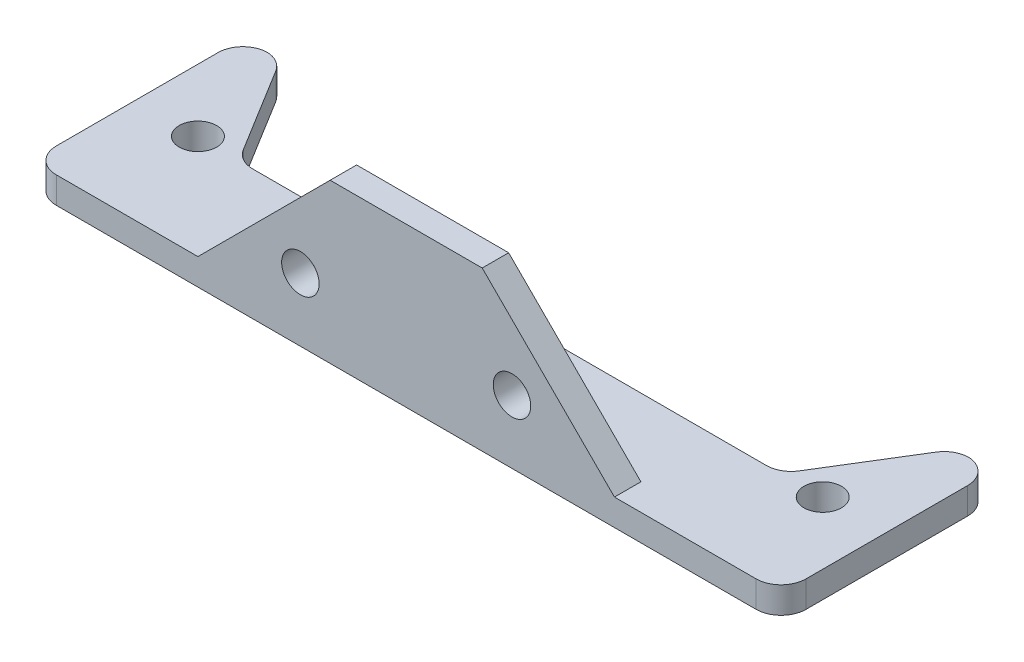
ISO-10303-21;
HEADER;
FILE_DESCRIPTION(('STEP AP214'),'2;1');
FILE_NAME('part.step','',(''),(''),'','','');
FILE_SCHEMA(('AUTOMOTIVE_DESIGN { 1 0 10303 214 1 1 1 1 }'));
ENDSEC;
DATA;
#1=APPLICATION_CONTEXT('core data for automotive mechanical design processes');
#2=APPLICATION_PROTOCOL_DEFINITION('international standard','automotive_design',2000,#1);
#3=PRODUCT_CONTEXT('',#1,'mechanical');
#4=PRODUCT('Part','Part','',(#3));
#5=PRODUCT_RELATED_PRODUCT_CATEGORY('part','',(#4));
#6=PRODUCT_DEFINITION_FORMATION('','',#4);
#7=PRODUCT_DEFINITION_CONTEXT('part definition',#1,'design');
#8=PRODUCT_DEFINITION('design','',#6,#7);
#9=PRODUCT_DEFINITION_SHAPE('','',#8);
#10=(LENGTH_UNIT() NAMED_UNIT(*) SI_UNIT(.MILLI.,.METRE.));
#11=(NAMED_UNIT(*) PLANE_ANGLE_UNIT() SI_UNIT($,.RADIAN.));
#12=(NAMED_UNIT(*) SI_UNIT($,.STERADIAN.) SOLID_ANGLE_UNIT());
#13=UNCERTAINTY_MEASURE_WITH_UNIT(LENGTH_MEASURE(1.E-05),#10,'distance_accuracy_value','');
#14=(GEOMETRIC_REPRESENTATION_CONTEXT(3) GLOBAL_UNCERTAINTY_ASSIGNED_CONTEXT((#13)) GLOBAL_UNIT_ASSIGNED_CONTEXT((#10,
#11,#12)) REPRESENTATION_CONTEXT('',''));
#15=CARTESIAN_POINT('',(0.,0.,0.));
#16=DIRECTION('',(0.,0.,1.));
#17=DIRECTION('',(1.,0.,0.));
#18=AXIS2_PLACEMENT_3D('',#15,#16,#17);
#19=CARTESIAN_POINT('',(25.,0.,-3.175));
#20=DIRECTION('',(0.,-1.,0.));
#21=DIRECTION('',(0.,0.,-1.));
#22=AXIS2_PLACEMENT_3D('',#19,#20,#21);
#23=PLANE('',#22);
#24=DIRECTION('',(-1.,0.,0.));
#25=VECTOR('',#24,1.);
#26=CARTESIAN_POINT('',(25.,0.,0.));
#27=LINE('',#26,#25);
#28=CARTESIAN_POINT('',(9.12500000000006,0.,0.));
#29=VERTEX_POINT('',#28);
#30=CARTESIAN_POINT('',(-9.12499999999983,0.,0.));
#31=VERTEX_POINT('',#30);
#32=EDGE_CURVE('E192',#29,#31,#27,.T.);
#33=ORIENTED_EDGE('',*,*,#32,.F.);
#34=DIRECTION('',(0.,0.,-1.));
#35=VECTOR('',#34,1.);
#36=CARTESIAN_POINT('',(9.12500000000006,0.,0.));
#37=LINE('',#36,#35);
#38=CARTESIAN_POINT('',(9.12500000000006,0.,-3.175));
#39=VERTEX_POINT('',#38);
#40=EDGE_CURVE('E198',#29,#39,#37,.T.);
#41=ORIENTED_EDGE('',*,*,#40,.T.);
#42=DIRECTION('',(-1.,0.,0.));
#43=VECTOR('',#42,1.);
#44=CARTESIAN_POINT('',(25.,0.,-3.175));
#45=LINE('',#44,#43);
#46=CARTESIAN_POINT('',(-9.12499999999983,0.,-3.175));
#47=VERTEX_POINT('',#46);
#48=EDGE_CURVE('E201',#39,#47,#45,.T.);
#49=ORIENTED_EDGE('',*,*,#48,.T.);
#50=DIRECTION('',(0.,0.,-1.));
#51=VECTOR('',#50,1.);
#52=CARTESIAN_POINT('',(-9.12499999999983,0.,0.));
#53=LINE('',#52,#51);
#54=EDGE_CURVE('E186',#31,#47,#53,.T.);
#55=ORIENTED_EDGE('',*,*,#54,.F.);
#56=EDGE_LOOP('',(#33,#41,#49,#55));
#57=FACE_BOUND('',#56,.T.);
#58=ADVANCED_FACE('F41',(#57),#23,.F.);
#59=CARTESIAN_POINT('',(25.,0.,0.));
#60=DIRECTION('',(0.,0.,-1.));
#61=DIRECTION('',(0.,1.,0.));
#62=AXIS2_PLACEMENT_3D('',#59,#60,#61);
#63=PLANE('',#62);
#64=CARTESIAN_POINT('',(12.7000000000001,-11.4453124999999,0.));
#65=DIRECTION('',(0.,0.,-1.));
#66=DIRECTION('',(0.,1.,0.));
#67=AXIS2_PLACEMENT_3D('',#64,#65,#66);
#68=CIRCLE('',#67,2.25);
#69=CARTESIAN_POINT('',(12.7000000000001,-9.19531249999994,0.));
#70=VERTEX_POINT('',#69);
#71=EDGE_CURVE('E355',#70,#70,#68,.T.);
#72=ORIENTED_EDGE('',*,*,#71,.T.);
#73=EDGE_LOOP('',(#72));
#74=FACE_BOUND('',#73,.T.);
#75=CARTESIAN_POINT('',(-12.6999999999999,-11.4453124999999,0.));
#76=DIRECTION('',(0.,0.,-1.));
#77=DIRECTION('',(0.,1.,0.));
#78=AXIS2_PLACEMENT_3D('',#75,#76,#77);
#79=CIRCLE('',#78,2.25);
#80=CARTESIAN_POINT('',(-12.6999999999999,-9.19531249999994,0.));
#81=VERTEX_POINT('',#80);
#82=EDGE_CURVE('E195',#81,#81,#79,.T.);
#83=ORIENTED_EDGE('',*,*,#82,.T.);
#84=EDGE_LOOP('',(#83));
#85=FACE_BOUND('',#84,.T.);
#86=DIRECTION('',(1.,0.,0.));
#87=VECTOR('',#86,1.);
#88=CARTESIAN_POINT('',(-45.,-15.875,0.));
#89=LINE('',#88,#87);
#90=CARTESIAN_POINT('',(-42.,-15.875,0.));
#91=VERTEX_POINT('',#90);
#92=CARTESIAN_POINT('',(-25.,-15.875,0.));
#93=VERTEX_POINT('',#92);
#94=EDGE_CURVE('E165',#91,#93,#89,.T.);
#95=ORIENTED_EDGE('',*,*,#94,.F.);
#96=DIRECTION('',(0.,1.,0.));
#97=VECTOR('',#96,1.);
#98=CARTESIAN_POINT('',(-42.,-19.05,0.));
#99=LINE('',#98,#97);
#100=CARTESIAN_POINT('',(-42.,-19.05,0.));
#101=VERTEX_POINT('',#100);
#102=EDGE_CURVE('E255',#91,#101,#99,.F.);
#103=ORIENTED_EDGE('',*,*,#102,.T.);
#104=DIRECTION('',(-1.,0.,0.));
#105=VECTOR('',#104,1.);
#106=CARTESIAN_POINT('',(25.,-19.05,0.));
#107=LINE('',#106,#105);
#108=CARTESIAN_POINT('',(42.,-19.05,0.));
#109=VERTEX_POINT('',#108);
#110=EDGE_CURVE('E205',#109,#101,#107,.T.);
#111=ORIENTED_EDGE('',*,*,#110,.F.);
#112=DIRECTION('',(0.,-1.,0.));
#113=VECTOR('',#112,1.);
#114=CARTESIAN_POINT('',(42.,-15.875,0.));
#115=LINE('',#114,#113);
#116=CARTESIAN_POINT('',(42.,-15.875,0.));
#117=VERTEX_POINT('',#116);
#118=EDGE_CURVE('E253',#109,#117,#115,.F.);
#119=ORIENTED_EDGE('',*,*,#118,.T.);
#120=DIRECTION('',(-1.,0.,0.));
#121=VECTOR('',#120,1.);
#122=CARTESIAN_POINT('',(45.,-15.875,0.));
#123=LINE('',#122,#121);
#124=CARTESIAN_POINT('',(25.,-15.875,0.));
#125=VERTEX_POINT('',#124);
#126=EDGE_CURVE('E350',#117,#125,#123,.T.);
#127=ORIENTED_EDGE('',*,*,#126,.T.);
#128=DIRECTION('',(-0.707106781186546,0.707106781186549,0.));
#129=VECTOR('',#128,1.);
#130=CARTESIAN_POINT('',(25.,-15.875,0.));
#131=LINE('',#130,#129);
#132=EDGE_CURVE('E214',#125,#29,#131,.T.);
#133=ORIENTED_EDGE('',*,*,#132,.T.);
#134=ORIENTED_EDGE('',*,*,#32,.T.);
#135=DIRECTION('',(-0.707106781186551,-0.707106781186544,0.));
#136=VECTOR('',#135,1.);
#137=CARTESIAN_POINT('',(-25.,-15.875,0.));
#138=LINE('',#137,#136);
#139=EDGE_CURVE('E180',#31,#93,#138,.T.);
#140=ORIENTED_EDGE('',*,*,#139,.T.);
#141=EDGE_LOOP('',(#95,#103,#111,#119,#127,#133,#134,#140));
#142=FACE_BOUND('',#141,.T.);
#143=ADVANCED_FACE('F189',(#74,#85,#142),#63,.F.);
#144=CARTESIAN_POINT('',(25.,-19.05,0.));
#145=DIRECTION('',(0.,1.,0.));
#146=DIRECTION('',(0.,0.,1.));
#147=AXIS2_PLACEMENT_3D('',#144,#145,#146);
#148=PLANE('',#147);
#149=CARTESIAN_POINT('',(37.5,-19.05,-12.5));
#150=DIRECTION('',(0.,1.,0.));
#151=DIRECTION('',(0.,0.,1.));
#152=AXIS2_PLACEMENT_3D('',#149,#150,#151);
#153=CIRCLE('',#152,2.25);
#154=CARTESIAN_POINT('',(37.5,-19.05,-10.25));
#155=VERTEX_POINT('',#154);
#156=EDGE_CURVE('E329',#155,#155,#153,.T.);
#157=ORIENTED_EDGE('',*,*,#156,.T.);
#158=EDGE_LOOP('',(#157));
#159=FACE_BOUND('',#158,.T.);
#160=CARTESIAN_POINT('',(-37.5,-19.05,-12.5));
#161=DIRECTION('',(0.,1.,0.));
#162=DIRECTION('',(0.,0.,1.));
#163=AXIS2_PLACEMENT_3D('',#160,#161,#162);
#164=CIRCLE('',#163,2.25);
#165=CARTESIAN_POINT('',(-37.5,-19.05,-10.25));
#166=VERTEX_POINT('',#165);
#167=EDGE_CURVE('E337',#166,#166,#164,.T.);
#168=ORIENTED_EDGE('',*,*,#167,.T.);
#169=EDGE_LOOP('',(#168));
#170=FACE_BOUND('',#169,.T.);
#171=ORIENTED_EDGE('',*,*,#110,.T.);
#172=CARTESIAN_POINT('',(-42.,-19.05,-3.));
#173=DIRECTION('',(0.,1.,0.));
#174=DIRECTION('',(0.,0.,1.));
#175=AXIS2_PLACEMENT_3D('',#172,#173,#174);
#176=CIRCLE('',#175,3.);
#177=CARTESIAN_POINT('',(-45.,-19.05,-3.));
#178=VERTEX_POINT('',#177);
#179=EDGE_CURVE('E265',#101,#178,#176,.F.);
#180=ORIENTED_EDGE('',*,*,#179,.T.);
#181=DIRECTION('',(0.,0.,1.));
#182=VECTOR('',#181,1.);
#183=CARTESIAN_POINT('',(-45.,-19.05,-25.4));
#184=LINE('',#183,#182);
#185=CARTESIAN_POINT('',(-45.,-19.05,-22.4));
#186=VERTEX_POINT('',#185);
#187=EDGE_CURVE('E340',#186,#178,#184,.T.);
#188=ORIENTED_EDGE('',*,*,#187,.F.);
#189=CARTESIAN_POINT('',(-42.,-19.05,-22.4));
#190=DIRECTION('',(0.,1.,0.));
#191=DIRECTION('',(0.,0.,1.));
#192=AXIS2_PLACEMENT_3D('',#189,#190,#191);
#193=CIRCLE('',#192,3.);
#194=CARTESIAN_POINT('',(-42.0881927910547,-19.05,-25.3987033917355));
#195=VERTEX_POINT('',#194);
#196=EDGE_CURVE('E65',#186,#195,#193,.F.);
#197=ORIENTED_EDGE('',*,*,#196,.T.);
#198=CARTESIAN_POINT('',(-42.1763855821093,-19.05,-22.4));
#199=DIRECTION('',(0.,1.,0.));
#200=DIRECTION('',(0.,0.,1.));
#201=AXIS2_PLACEMENT_3D('',#198,#199,#200);
#202=CIRCLE('',#201,3.);
#203=CARTESIAN_POINT('',(-39.6214106319957,-19.05,-23.972292276993));
#204=VERTEX_POINT('',#203);
#205=EDGE_CURVE('E257',#195,#204,#202,.F.);
#206=ORIENTED_EDGE('',*,*,#205,.T.);
#207=DIRECTION('',(-0.524097425664333,0.,-0.851658316704545));
#208=VECTOR('',#207,1.);
#209=CARTESIAN_POINT('',(-32.5,-19.05,-12.3999999999999));
#210=LINE('',#209,#208);
#211=CARTESIAN_POINT('',(-33.3785893680044,-19.05,-13.827707723007));
#212=VERTEX_POINT('',#211);
#213=EDGE_CURVE('E233',#204,#212,#210,.F.);
#214=ORIENTED_EDGE('',*,*,#213,.T.);
#215=CARTESIAN_POINT('',(-30.8236144178907,-19.05,-15.4));
#216=DIRECTION('',(0.,1.,0.));
#217=DIRECTION('',(0.,0.,1.));
#218=AXIS2_PLACEMENT_3D('',#215,#216,#217);
#219=CIRCLE('',#218,3.);
#220=CARTESIAN_POINT('',(-30.8236144178907,-19.05,-12.4));
#221=VERTEX_POINT('',#220);
#222=EDGE_CURVE('E11',#212,#221,#219,.T.);
#223=ORIENTED_EDGE('',*,*,#222,.T.);
#224=DIRECTION('',(1.,0.,0.));
#225=VECTOR('',#224,1.);
#226=CARTESIAN_POINT('',(-32.5,-19.05,-12.4));
#227=LINE('',#226,#225);
#228=CARTESIAN_POINT('',(30.8236144178907,-19.05,-12.4));
#229=VERTEX_POINT('',#228);
#230=EDGE_CURVE('E298',#221,#229,#227,.T.);
#231=ORIENTED_EDGE('',*,*,#230,.T.);
#232=CARTESIAN_POINT('',(30.8236144178907,-19.05,-15.4));
#233=DIRECTION('',(0.,1.,0.));
#234=DIRECTION('',(0.,0.,1.));
#235=AXIS2_PLACEMENT_3D('',#232,#233,#234);
#236=CIRCLE('',#235,3.);
#237=CARTESIAN_POINT('',(33.3785893680044,-19.05,-13.827707723007));
#238=VERTEX_POINT('',#237);
#239=EDGE_CURVE('E289',#229,#238,#236,.T.);
#240=ORIENTED_EDGE('',*,*,#239,.T.);
#241=DIRECTION('',(0.524097425664333,0.,-0.851658316704545));
#242=VECTOR('',#241,1.);
#243=CARTESIAN_POINT('',(40.5,-19.05,-25.4));
#244=LINE('',#243,#242);
#245=CARTESIAN_POINT('',(39.6214106319957,-19.05,-23.972292276993));
#246=VERTEX_POINT('',#245);
#247=EDGE_CURVE('E228',#238,#246,#244,.T.);
#248=ORIENTED_EDGE('',*,*,#247,.T.);
#249=CARTESIAN_POINT('',(42.1763855821093,-19.05,-22.4));
#250=DIRECTION('',(0.,1.,0.));
#251=DIRECTION('',(0.,0.,1.));
#252=AXIS2_PLACEMENT_3D('',#249,#250,#251);
#253=CIRCLE('',#252,3.);
#254=CARTESIAN_POINT('',(42.0881927910547,-19.05,-25.3987033917355));
#255=VERTEX_POINT('',#254);
#256=EDGE_CURVE('E58',#246,#255,#253,.F.);
#257=ORIENTED_EDGE('',*,*,#256,.T.);
#258=CARTESIAN_POINT('',(42.,-19.05,-22.4));
#259=DIRECTION('',(0.,1.,0.));
#260=DIRECTION('',(0.,0.,1.));
#261=AXIS2_PLACEMENT_3D('',#258,#259,#260);
#262=CIRCLE('',#261,3.);
#263=CARTESIAN_POINT('',(45.,-19.05,-22.4));
#264=VERTEX_POINT('',#263);
#265=EDGE_CURVE('E260',#255,#264,#262,.F.);
#266=ORIENTED_EDGE('',*,*,#265,.T.);
#267=DIRECTION('',(0.,0.,-1.));
#268=VECTOR('',#267,1.);
#269=CARTESIAN_POINT('',(45.,-19.05,0.));
#270=LINE('',#269,#268);
#271=CARTESIAN_POINT('',(45.,-19.05,-3.));
#272=VERTEX_POINT('',#271);
#273=EDGE_CURVE('E175',#272,#264,#270,.T.);
#274=ORIENTED_EDGE('',*,*,#273,.F.);
#275=CARTESIAN_POINT('',(42.,-19.05,-3.));
#276=DIRECTION('',(0.,1.,0.));
#277=DIRECTION('',(0.,0.,1.));
#278=AXIS2_PLACEMENT_3D('',#275,#276,#277);
#279=CIRCLE('',#278,3.);
#280=EDGE_CURVE('E263',#272,#109,#279,.F.);
#281=ORIENTED_EDGE('',*,*,#280,.T.);
#282=EDGE_LOOP('',(#171,#180,#188,#197,#206,#214,#223,#231,#240,#248,#257,#266,#274,#281));
#283=FACE_BOUND('',#282,.T.);
#284=ADVANCED_FACE('F310',(#159,#170,#283),#148,.F.);
#285=CARTESIAN_POINT('',(25.,-15.875,-25.4));
#286=DIRECTION('',(0.,-1.,0.));
#287=DIRECTION('',(0.,0.,-1.));
#288=AXIS2_PLACEMENT_3D('',#285,#286,#287);
#289=PLANE('',#288);
#290=CARTESIAN_POINT('',(37.5,-15.875,-12.5));
#291=DIRECTION('',(0.,1.,0.));
#292=DIRECTION('',(0.,0.,1.));
#293=AXIS2_PLACEMENT_3D('',#290,#291,#292);
#294=CIRCLE('',#293,2.24999999999999);
#295=CARTESIAN_POINT('',(37.5,-15.875,-10.25));
#296=VERTEX_POINT('',#295);
#297=EDGE_CURVE('E326',#296,#296,#294,.T.);
#298=ORIENTED_EDGE('',*,*,#297,.F.);
#299=EDGE_LOOP('',(#298));
#300=FACE_BOUND('',#299,.T.);
#301=CARTESIAN_POINT('',(-37.5,-15.875,-12.5));
#302=DIRECTION('',(0.,1.,0.));
#303=DIRECTION('',(0.,0.,1.));
#304=AXIS2_PLACEMENT_3D('',#301,#302,#303);
#305=CIRCLE('',#304,2.24999999999999);
#306=CARTESIAN_POINT('',(-37.5,-15.875,-10.25));
#307=VERTEX_POINT('',#306);
#308=EDGE_CURVE('E334',#307,#307,#305,.T.);
#309=ORIENTED_EDGE('',*,*,#308,.F.);
#310=EDGE_LOOP('',(#309));
#311=FACE_BOUND('',#310,.T.);
#312=DIRECTION('',(0.,0.,-1.));
#313=VECTOR('',#312,1.);
#314=CARTESIAN_POINT('',(-45.,-15.875,-25.4));
#315=LINE('',#314,#313);
#316=CARTESIAN_POINT('',(-45.,-15.875,-3.));
#317=VERTEX_POINT('',#316);
#318=CARTESIAN_POINT('',(-45.,-15.875,-22.4));
#319=VERTEX_POINT('',#318);
#320=EDGE_CURVE('E176',#317,#319,#315,.T.);
#321=ORIENTED_EDGE('',*,*,#320,.F.);
#322=CARTESIAN_POINT('',(-42.,-15.875,-3.));
#323=DIRECTION('',(0.,-1.,0.));
#324=DIRECTION('',(0.,0.,-1.));
#325=AXIS2_PLACEMENT_3D('',#322,#323,#324);
#326=CIRCLE('',#325,3.);
#327=EDGE_CURVE('E171',#317,#91,#326,.F.);
#328=ORIENTED_EDGE('',*,*,#327,.T.);
#329=ORIENTED_EDGE('',*,*,#94,.T.);
#330=DIRECTION('',(0.,0.,-1.));
#331=VECTOR('',#330,1.);
#332=CARTESIAN_POINT('',(-25.,-15.875,0.));
#333=LINE('',#332,#331);
#334=CARTESIAN_POINT('',(-25.,-15.875,-3.175));
#335=VERTEX_POINT('',#334);
#336=EDGE_CURVE('E169',#93,#335,#333,.T.);
#337=ORIENTED_EDGE('',*,*,#336,.T.);
#338=DIRECTION('',(-1.,0.,0.));
#339=VECTOR('',#338,1.);
#340=CARTESIAN_POINT('',(25.,-15.875,-3.175));
#341=LINE('',#340,#339);
#342=CARTESIAN_POINT('',(25.,-15.875,-3.175));
#343=VERTEX_POINT('',#342);
#344=EDGE_CURVE('E204',#343,#335,#341,.T.);
#345=ORIENTED_EDGE('',*,*,#344,.F.);
#346=DIRECTION('',(0.,0.,-1.));
#347=VECTOR('',#346,1.);
#348=CARTESIAN_POINT('',(25.,-15.875,0.));
#349=LINE('',#348,#347);
#350=EDGE_CURVE('E217',#125,#343,#349,.T.);
#351=ORIENTED_EDGE('',*,*,#350,.F.);
#352=ORIENTED_EDGE('',*,*,#126,.F.);
#353=CARTESIAN_POINT('',(42.,-15.875,-3.));
#354=DIRECTION('',(0.,-1.,0.));
#355=DIRECTION('',(0.,0.,-1.));
#356=AXIS2_PLACEMENT_3D('',#353,#354,#355);
#357=CIRCLE('',#356,3.);
#358=CARTESIAN_POINT('',(45.,-15.875,-3.));
#359=VERTEX_POINT('',#358);
#360=EDGE_CURVE('E250',#117,#359,#357,.F.);
#361=ORIENTED_EDGE('',*,*,#360,.T.);
#362=DIRECTION('',(0.,0.,1.));
#363=VECTOR('',#362,1.);
#364=CARTESIAN_POINT('',(45.,-15.875,0.));
#365=LINE('',#364,#363);
#366=CARTESIAN_POINT('',(45.,-15.875,-22.4));
#367=VERTEX_POINT('',#366);
#368=EDGE_CURVE('E347',#367,#359,#365,.T.);
#369=ORIENTED_EDGE('',*,*,#368,.F.);
#370=CARTESIAN_POINT('',(42.,-15.875,-22.4));
#371=DIRECTION('',(0.,-1.,0.));
#372=DIRECTION('',(0.,0.,-1.));
#373=AXIS2_PLACEMENT_3D('',#370,#371,#372);
#374=CIRCLE('',#373,3.);
#375=CARTESIAN_POINT('',(42.0881927910547,-15.875,-25.3987033917355));
#376=VERTEX_POINT('',#375);
#377=EDGE_CURVE('E246',#367,#376,#374,.F.);
#378=ORIENTED_EDGE('',*,*,#377,.T.);
#379=CARTESIAN_POINT('',(42.1763855821093,-15.875,-22.4));
#380=DIRECTION('',(0.,-1.,0.));
#381=DIRECTION('',(0.,0.,-1.));
#382=AXIS2_PLACEMENT_3D('',#379,#380,#381);
#383=CIRCLE('',#382,3.);
#384=CARTESIAN_POINT('',(39.6214106319957,-15.875,-23.972292276993));
#385=VERTEX_POINT('',#384);
#386=EDGE_CURVE('E248',#376,#385,#383,.F.);
#387=ORIENTED_EDGE('',*,*,#386,.T.);
#388=DIRECTION('',(-0.524097425664333,0.,0.851658316704545));
#389=VECTOR('',#388,1.);
#390=CARTESIAN_POINT('',(40.5,-15.875,-25.4));
#391=LINE('',#390,#389);
#392=CARTESIAN_POINT('',(33.3785893680044,-15.875,-13.827707723007));
#393=VERTEX_POINT('',#392);
#394=EDGE_CURVE('E209',#385,#393,#391,.T.);
#395=ORIENTED_EDGE('',*,*,#394,.T.);
#396=CARTESIAN_POINT('',(30.8236144178907,-15.875,-15.4));
#397=DIRECTION('',(0.,-1.,0.));
#398=DIRECTION('',(0.,0.,-1.));
#399=AXIS2_PLACEMENT_3D('',#396,#397,#398);
#400=CIRCLE('',#399,3.);
#401=CARTESIAN_POINT('',(30.8236144178907,-15.875,-12.4));
#402=VERTEX_POINT('',#401);
#403=EDGE_CURVE('E287',#393,#402,#400,.T.);
#404=ORIENTED_EDGE('',*,*,#403,.T.);
#405=DIRECTION('',(1.,0.,0.));
#406=VECTOR('',#405,1.);
#407=CARTESIAN_POINT('',(-32.5,-15.875,-12.4));
#408=LINE('',#407,#406);
#409=CARTESIAN_POINT('',(-30.8236144178907,-15.875,-12.4));
#410=VERTEX_POINT('',#409);
#411=EDGE_CURVE('E293',#410,#402,#408,.T.);
#412=ORIENTED_EDGE('',*,*,#411,.F.);
#413=CARTESIAN_POINT('',(-30.8236144178907,-15.875,-15.4));
#414=DIRECTION('',(0.,-1.,0.));
#415=DIRECTION('',(0.,0.,-1.));
#416=AXIS2_PLACEMENT_3D('',#413,#414,#415);
#417=CIRCLE('',#416,3.);
#418=CARTESIAN_POINT('',(-33.3785893680044,-15.875,-13.827707723007));
#419=VERTEX_POINT('',#418);
#420=EDGE_CURVE('E50',#410,#419,#417,.T.);
#421=ORIENTED_EDGE('',*,*,#420,.T.);
#422=DIRECTION('',(0.524097425664333,0.,0.851658316704545));
#423=VECTOR('',#422,1.);
#424=CARTESIAN_POINT('',(-32.5,-15.875,-12.3999999999999));
#425=LINE('',#424,#423);
#426=CARTESIAN_POINT('',(-39.6214106319957,-15.875,-23.972292276993));
#427=VERTEX_POINT('',#426);
#428=EDGE_CURVE('E230',#419,#427,#425,.F.);
#429=ORIENTED_EDGE('',*,*,#428,.T.);
#430=CARTESIAN_POINT('',(-42.1763855821093,-15.875,-22.4));
#431=DIRECTION('',(0.,-1.,0.));
#432=DIRECTION('',(0.,0.,-1.));
#433=AXIS2_PLACEMENT_3D('',#430,#431,#432);
#434=CIRCLE('',#433,3.);
#435=CARTESIAN_POINT('',(-42.0881927910547,-15.875,-25.3987033917355));
#436=VERTEX_POINT('',#435);
#437=EDGE_CURVE('E242',#427,#436,#434,.F.);
#438=ORIENTED_EDGE('',*,*,#437,.T.);
#439=CARTESIAN_POINT('',(-42.,-15.875,-22.4));
#440=DIRECTION('',(0.,-1.,0.));
#441=DIRECTION('',(0.,0.,-1.));
#442=AXIS2_PLACEMENT_3D('',#439,#440,#441);
#443=CIRCLE('',#442,3.);
#444=EDGE_CURVE('E244',#436,#319,#443,.F.);
#445=ORIENTED_EDGE('',*,*,#444,.T.);
#446=EDGE_LOOP('',(#321,#328,#329,#337,#345,#351,#352,#361,#369,#378,#387,#395,#404,#412,#421,
#429,#438,#445));
#447=FACE_BOUND('',#446,.T.);
#448=ADVANCED_FACE('F168',(#300,#311,#447),#289,.F.);
#449=CARTESIAN_POINT('',(25.,-15.875,-3.175));
#450=DIRECTION('',(0.,0.,1.));
#451=DIRECTION('',(0.,-1.,0.));
#452=AXIS2_PLACEMENT_3D('',#449,#450,#451);
#453=PLANE('',#452);
#454=CARTESIAN_POINT('',(12.7000000000001,-11.4453124999999,-3.175));
#455=DIRECTION('',(0.,0.,-1.));
#456=DIRECTION('',(0.,1.,0.));
#457=AXIS2_PLACEMENT_3D('',#454,#455,#456);
#458=CIRCLE('',#457,2.24999999999999);
#459=CARTESIAN_POINT('',(12.7000000000001,-9.19531249999996,-3.175));
#460=VERTEX_POINT('',#459);
#461=EDGE_CURVE('E352',#460,#460,#458,.T.);
#462=ORIENTED_EDGE('',*,*,#461,.F.);
#463=EDGE_LOOP('',(#462));
#464=FACE_BOUND('',#463,.T.);
#465=CARTESIAN_POINT('',(-12.6999999999999,-11.4453124999999,-3.175));
#466=DIRECTION('',(0.,0.,-1.));
#467=DIRECTION('',(0.,1.,0.));
#468=AXIS2_PLACEMENT_3D('',#465,#466,#467);
#469=CIRCLE('',#468,2.24999999999999);
#470=CARTESIAN_POINT('',(-12.6999999999999,-9.19531249999996,-3.175));
#471=VERTEX_POINT('',#470);
#472=EDGE_CURVE('E358',#471,#471,#469,.T.);
#473=ORIENTED_EDGE('',*,*,#472,.F.);
#474=EDGE_LOOP('',(#473));
#475=FACE_BOUND('',#474,.T.);
#476=ORIENTED_EDGE('',*,*,#48,.F.);
#477=DIRECTION('',(-0.707106781186546,0.707106781186549,0.));
#478=VECTOR('',#477,1.);
#479=CARTESIAN_POINT('',(25.,-15.875,-3.175));
#480=LINE('',#479,#478);
#481=EDGE_CURVE('E185',#343,#39,#480,.T.);
#482=ORIENTED_EDGE('',*,*,#481,.F.);
#483=ORIENTED_EDGE('',*,*,#344,.T.);
#484=DIRECTION('',(-0.707106781186551,-0.707106781186544,0.));
#485=VECTOR('',#484,1.);
#486=CARTESIAN_POINT('',(-25.,-15.875,-3.175));
#487=LINE('',#486,#485);
#488=EDGE_CURVE('E183',#47,#335,#487,.T.);
#489=ORIENTED_EDGE('',*,*,#488,.F.);
#490=EDGE_LOOP('',(#476,#482,#483,#489));
#491=FACE_BOUND('',#490,.T.);
#492=ADVANCED_FACE('F370',(#464,#475,#491),#453,.F.);
#493=CARTESIAN_POINT('',(-25.,-15.875,0.));
#494=DIRECTION('',(0.707106781186544,-0.707106781186551,0.));
#495=DIRECTION('',(0.707106781186551,0.707106781186544,0.));
#496=AXIS2_PLACEMENT_3D('',#493,#494,#495);
#497=PLANE('',#496);
#498=ORIENTED_EDGE('',*,*,#488,.T.);
#499=ORIENTED_EDGE('',*,*,#336,.F.);
#500=ORIENTED_EDGE('',*,*,#139,.F.);
#501=ORIENTED_EDGE('',*,*,#54,.T.);
#502=EDGE_LOOP('',(#498,#499,#500,#501));
#503=FACE_BOUND('',#502,.T.);
#504=ADVANCED_FACE('F179',(#503),#497,.F.);
#505=CARTESIAN_POINT('',(25.,-15.875,0.));
#506=DIRECTION('',(-0.707106781186549,-0.707106781186546,0.));
#507=DIRECTION('',(0.707106781186546,-0.707106781186549,0.));
#508=AXIS2_PLACEMENT_3D('',#505,#506,#507);
#509=PLANE('',#508);
#510=ORIENTED_EDGE('',*,*,#481,.T.);
#511=ORIENTED_EDGE('',*,*,#40,.F.);
#512=ORIENTED_EDGE('',*,*,#132,.F.);
#513=ORIENTED_EDGE('',*,*,#350,.T.);
#514=EDGE_LOOP('',(#510,#511,#512,#513));
#515=FACE_BOUND('',#514,.T.);
#516=ADVANCED_FACE('F373',(#515),#509,.F.);
#517=CARTESIAN_POINT('',(-12.6999999999999,-11.4453124999999,-3.175));
#518=DIRECTION('',(0.,0.,-1.));
#519=DIRECTION('',(0.,1.,0.));
#520=AXIS2_PLACEMENT_3D('',#517,#518,#519);
#521=CYLINDRICAL_SURFACE('',#520,2.24999999999999);
#522=ORIENTED_EDGE('',*,*,#82,.F.);
#523=EDGE_LOOP('',(#522));
#524=FACE_BOUND('',#523,.T.);
#525=ORIENTED_EDGE('',*,*,#472,.T.);
#526=EDGE_LOOP('',(#525));
#527=FACE_BOUND('',#526,.T.);
#528=ADVANCED_FACE('F375',(#524,#527),#521,.F.);
#529=CARTESIAN_POINT('',(12.7000000000001,-11.4453124999999,-3.175));
#530=DIRECTION('',(0.,0.,-1.));
#531=DIRECTION('',(0.,1.,0.));
#532=AXIS2_PLACEMENT_3D('',#529,#530,#531);
#533=CYLINDRICAL_SURFACE('',#532,2.24999999999999);
#534=ORIENTED_EDGE('',*,*,#71,.F.);
#535=EDGE_LOOP('',(#534));
#536=FACE_BOUND('',#535,.T.);
#537=ORIENTED_EDGE('',*,*,#461,.T.);
#538=EDGE_LOOP('',(#537));
#539=FACE_BOUND('',#538,.T.);
#540=ADVANCED_FACE('F382',(#536,#539),#533,.F.);
#541=CARTESIAN_POINT('',(45.,0.,0.));
#542=DIRECTION('',(1.,0.,0.));
#543=DIRECTION('',(0.,0.,-1.));
#544=AXIS2_PLACEMENT_3D('',#541,#542,#543);
#545=PLANE('',#544);
#546=ORIENTED_EDGE('',*,*,#368,.T.);
#547=DIRECTION('',(0.,-1.,0.));
#548=VECTOR('',#547,1.);
#549=CARTESIAN_POINT('',(45.,-19.05,-3.));
#550=LINE('',#549,#548);
#551=EDGE_CURVE('E269',#359,#272,#550,.T.);
#552=ORIENTED_EDGE('',*,*,#551,.T.);
#553=ORIENTED_EDGE('',*,*,#273,.T.);
#554=DIRECTION('',(0.,1.,0.));
#555=VECTOR('',#554,1.);
#556=CARTESIAN_POINT('',(45.,-15.875,-22.4));
#557=LINE('',#556,#555);
#558=EDGE_CURVE('E267',#264,#367,#557,.T.);
#559=ORIENTED_EDGE('',*,*,#558,.T.);
#560=EDGE_LOOP('',(#546,#552,#553,#559));
#561=FACE_BOUND('',#560,.T.);
#562=ADVANCED_FACE('F492',(#561),#545,.T.);
#563=CARTESIAN_POINT('',(-45.,0.,0.));
#564=DIRECTION('',(-1.,0.,0.));
#565=DIRECTION('',(0.,0.,1.));
#566=AXIS2_PLACEMENT_3D('',#563,#564,#565);
#567=PLANE('',#566);
#568=ORIENTED_EDGE('',*,*,#187,.T.);
#569=DIRECTION('',(0.,1.,0.));
#570=VECTOR('',#569,1.);
#571=CARTESIAN_POINT('',(-45.,-15.875,-3.));
#572=LINE('',#571,#570);
#573=EDGE_CURVE('E239',#178,#317,#572,.T.);
#574=ORIENTED_EDGE('',*,*,#573,.T.);
#575=ORIENTED_EDGE('',*,*,#320,.T.);
#576=DIRECTION('',(0.,-1.,0.));
#577=VECTOR('',#576,1.);
#578=CARTESIAN_POINT('',(-45.,-19.05,-22.4));
#579=LINE('',#578,#577);
#580=EDGE_CURVE('E236',#319,#186,#579,.T.);
#581=ORIENTED_EDGE('',*,*,#580,.T.);
#582=EDGE_LOOP('',(#568,#574,#575,#581));
#583=FACE_BOUND('',#582,.T.);
#584=ADVANCED_FACE('F487',(#583),#567,.T.);
#585=CARTESIAN_POINT('',(-37.5,-15.875,-12.5));
#586=DIRECTION('',(0.,1.,0.));
#587=DIRECTION('',(0.,0.,1.));
#588=AXIS2_PLACEMENT_3D('',#585,#586,#587);
#589=CYLINDRICAL_SURFACE('',#588,2.25);
#590=ORIENTED_EDGE('',*,*,#167,.F.);
#591=EDGE_LOOP('',(#590));
#592=FACE_BOUND('',#591,.T.);
#593=ORIENTED_EDGE('',*,*,#308,.T.);
#594=EDGE_LOOP('',(#593));
#595=FACE_BOUND('',#594,.T.);
#596=ADVANCED_FACE('F491',(#592,#595),#589,.F.);
#597=CARTESIAN_POINT('',(37.5,-15.875,-12.5));
#598=DIRECTION('',(0.,1.,0.));
#599=DIRECTION('',(0.,0.,1.));
#600=AXIS2_PLACEMENT_3D('',#597,#598,#599);
#601=CYLINDRICAL_SURFACE('',#600,2.25);
#602=ORIENTED_EDGE('',*,*,#156,.F.);
#603=EDGE_LOOP('',(#602));
#604=FACE_BOUND('',#603,.T.);
#605=ORIENTED_EDGE('',*,*,#297,.T.);
#606=EDGE_LOOP('',(#605));
#607=FACE_BOUND('',#606,.T.);
#608=ADVANCED_FACE('F481',(#604,#607),#601,.F.);
#609=CARTESIAN_POINT('',(-32.5,-19.05,-12.4));
#610=DIRECTION('',(0.,0.,1.));
#611=DIRECTION('',(0.,-1.,0.));
#612=AXIS2_PLACEMENT_3D('',#609,#610,#611);
#613=PLANE('',#612);
#614=ORIENTED_EDGE('',*,*,#411,.T.);
#615=DIRECTION('',(0.,1.,0.));
#616=VECTOR('',#615,1.);
#617=CARTESIAN_POINT('',(30.8236144178907,-19.05,-12.4));
#618=LINE('',#617,#616);
#619=EDGE_CURVE('E281',#402,#229,#618,.F.);
#620=ORIENTED_EDGE('',*,*,#619,.T.);
#621=ORIENTED_EDGE('',*,*,#230,.F.);
#622=DIRECTION('',(0.,-1.,0.));
#623=VECTOR('',#622,1.);
#624=CARTESIAN_POINT('',(-30.8236144178907,-19.05,-12.4));
#625=LINE('',#624,#623);
#626=EDGE_CURVE('E278',#221,#410,#625,.F.);
#627=ORIENTED_EDGE('',*,*,#626,.T.);
#628=EDGE_LOOP('',(#614,#620,#621,#627));
#629=FACE_BOUND('',#628,.T.);
#630=ADVANCED_FACE('F323',(#629),#613,.F.);
#631=CARTESIAN_POINT('',(40.5,-19.05,-25.4));
#632=DIRECTION('',(-0.851658316704545,0.,-0.524097425664333));
#633=DIRECTION('',(0.,-1.,0.));
#634=AXIS2_PLACEMENT_3D('',#631,#632,#633);
#635=PLANE('',#634);
#636=ORIENTED_EDGE('',*,*,#247,.F.);
#637=DIRECTION('',(0.,1.,0.));
#638=VECTOR('',#637,1.);
#639=CARTESIAN_POINT('',(33.3785893680044,-19.05,-13.827707723007));
#640=LINE('',#639,#638);
#641=EDGE_CURVE('E275',#238,#393,#640,.T.);
#642=ORIENTED_EDGE('',*,*,#641,.T.);
#643=ORIENTED_EDGE('',*,*,#394,.F.);
#644=DIRECTION('',(0.,1.,0.));
#645=VECTOR('',#644,1.);
#646=CARTESIAN_POINT('',(39.6214106319957,-19.05,-23.972292276993));
#647=LINE('',#646,#645);
#648=EDGE_CURVE('E272',#385,#246,#647,.F.);
#649=ORIENTED_EDGE('',*,*,#648,.T.);
#650=EDGE_LOOP('',(#636,#642,#643,#649));
#651=FACE_BOUND('',#650,.T.);
#652=ADVANCED_FACE('F397',(#651),#635,.T.);
#653=CARTESIAN_POINT('',(-32.5,-19.05,-12.3999999999999));
#654=DIRECTION('',(-0.851658316704545,0.,0.524097425664333));
#655=DIRECTION('',(0.,1.,0.));
#656=AXIS2_PLACEMENT_3D('',#653,#654,#655);
#657=PLANE('',#656);
#658=ORIENTED_EDGE('',*,*,#428,.F.);
#659=DIRECTION('',(0.,1.,0.));
#660=VECTOR('',#659,1.);
#661=CARTESIAN_POINT('',(-33.3785893680044,-19.05,-13.827707723007));
#662=LINE('',#661,#660);
#663=EDGE_CURVE('E285',#419,#212,#662,.F.);
#664=ORIENTED_EDGE('',*,*,#663,.T.);
#665=ORIENTED_EDGE('',*,*,#213,.F.);
#666=DIRECTION('',(0.,-1.,0.));
#667=VECTOR('',#666,1.);
#668=CARTESIAN_POINT('',(-39.6214106319957,-15.875,-23.972292276993));
#669=LINE('',#668,#667);
#670=EDGE_CURVE('E283',#204,#427,#669,.F.);
#671=ORIENTED_EDGE('',*,*,#670,.T.);
#672=EDGE_LOOP('',(#658,#664,#665,#671));
#673=FACE_BOUND('',#672,.T.);
#674=ADVANCED_FACE('F314',(#673),#657,.F.);
#675=CARTESIAN_POINT('',(-42.,0.,-3.));
#676=DIRECTION('',(0.,-1.,0.));
#677=DIRECTION('',(0.,0.,-1.));
#678=AXIS2_PLACEMENT_3D('',#675,#676,#677);
#679=CYLINDRICAL_SURFACE('',#678,3.);
#680=ORIENTED_EDGE('',*,*,#179,.F.);
#681=ORIENTED_EDGE('',*,*,#102,.F.);
#682=ORIENTED_EDGE('',*,*,#327,.F.);
#683=ORIENTED_EDGE('',*,*,#573,.F.);
#684=EDGE_LOOP('',(#680,#681,#682,#683));
#685=FACE_BOUND('',#684,.T.);
#686=ADVANCED_FACE('F408',(#685),#679,.T.);
#687=CARTESIAN_POINT('',(42.,0.,-3.));
#688=DIRECTION('',(0.,1.,0.));
#689=DIRECTION('',(0.,0.,1.));
#690=AXIS2_PLACEMENT_3D('',#687,#688,#689);
#691=CYLINDRICAL_SURFACE('',#690,3.);
#692=ORIENTED_EDGE('',*,*,#360,.F.);
#693=ORIENTED_EDGE('',*,*,#118,.F.);
#694=ORIENTED_EDGE('',*,*,#280,.F.);
#695=ORIENTED_EDGE('',*,*,#551,.F.);
#696=EDGE_LOOP('',(#692,#693,#694,#695));
#697=FACE_BOUND('',#696,.T.);
#698=ADVANCED_FACE('F411',(#697),#691,.T.);
#699=CARTESIAN_POINT('',(30.8236144178907,-19.05,-15.4));
#700=DIRECTION('',(0.,1.,0.));
#701=DIRECTION('',(0.,0.,1.));
#702=AXIS2_PLACEMENT_3D('',#699,#700,#701);
#703=CYLINDRICAL_SURFACE('',#702,3.);
#704=ORIENTED_EDGE('',*,*,#239,.F.);
#705=ORIENTED_EDGE('',*,*,#619,.F.);
#706=ORIENTED_EDGE('',*,*,#403,.F.);
#707=ORIENTED_EDGE('',*,*,#641,.F.);
#708=EDGE_LOOP('',(#704,#705,#706,#707));
#709=FACE_BOUND('',#708,.T.);
#710=ADVANCED_FACE('F415',(#709),#703,.F.);
#711=CARTESIAN_POINT('',(42.,0.,-22.4));
#712=DIRECTION('',(0.,-1.,0.));
#713=DIRECTION('',(0.,0.,-1.));
#714=AXIS2_PLACEMENT_3D('',#711,#712,#713);
#715=CYLINDRICAL_SURFACE('',#714,3.);
#716=ORIENTED_EDGE('',*,*,#558,.F.);
#717=ORIENTED_EDGE('',*,*,#265,.F.);
#718=DIRECTION('',(0.,-1.,0.));
#719=VECTOR('',#718,1.);
#720=CARTESIAN_POINT('',(42.0881927910547,-17.4625,-25.3987033917355));
#721=LINE('',#720,#719);
#722=EDGE_CURVE('E291',#376,#255,#721,.T.);
#723=ORIENTED_EDGE('',*,*,#722,.F.);
#724=ORIENTED_EDGE('',*,*,#377,.F.);
#725=EDGE_LOOP('',(#716,#717,#723,#724));
#726=FACE_BOUND('',#725,.T.);
#727=ADVANCED_FACE('F419',(#726),#715,.T.);
#728=CARTESIAN_POINT('',(42.1763855821093,-19.05,-22.4));
#729=DIRECTION('',(0.,-1.,0.));
#730=DIRECTION('',(0.,0.,-1.));
#731=AXIS2_PLACEMENT_3D('',#728,#729,#730);
#732=CYLINDRICAL_SURFACE('',#731,3.);
#733=ORIENTED_EDGE('',*,*,#256,.F.);
#734=ORIENTED_EDGE('',*,*,#648,.F.);
#735=ORIENTED_EDGE('',*,*,#386,.F.);
#736=ORIENTED_EDGE('',*,*,#722,.T.);
#737=EDGE_LOOP('',(#733,#734,#735,#736));
#738=FACE_BOUND('',#737,.T.);
#739=ADVANCED_FACE('F421',(#738),#732,.T.);
#740=CARTESIAN_POINT('',(-30.8236144178907,-19.05,-15.4));
#741=DIRECTION('',(0.,-1.,0.));
#742=DIRECTION('',(0.,0.,-1.));
#743=AXIS2_PLACEMENT_3D('',#740,#741,#742);
#744=CYLINDRICAL_SURFACE('',#743,3.);
#745=ORIENTED_EDGE('',*,*,#222,.F.);
#746=ORIENTED_EDGE('',*,*,#663,.F.);
#747=ORIENTED_EDGE('',*,*,#420,.F.);
#748=ORIENTED_EDGE('',*,*,#626,.F.);
#749=EDGE_LOOP('',(#745,#746,#747,#748));
#750=FACE_BOUND('',#749,.T.);
#751=ADVANCED_FACE('F317',(#750),#744,.F.);
#752=CARTESIAN_POINT('',(-42.1763855821093,-19.05,-22.4));
#753=DIRECTION('',(0.,-1.,0.));
#754=DIRECTION('',(0.,0.,-1.));
#755=AXIS2_PLACEMENT_3D('',#752,#753,#754);
#756=CYLINDRICAL_SURFACE('',#755,3.);
#757=DIRECTION('',(0.,-1.,0.));
#758=VECTOR('',#757,1.);
#759=CARTESIAN_POINT('',(-42.0881927910547,-17.4625,-25.3987033917355));
#760=LINE('',#759,#758);
#761=EDGE_CURVE('E45',#436,#195,#760,.T.);
#762=ORIENTED_EDGE('',*,*,#761,.F.);
#763=ORIENTED_EDGE('',*,*,#437,.F.);
#764=ORIENTED_EDGE('',*,*,#670,.F.);
#765=ORIENTED_EDGE('',*,*,#205,.F.);
#766=EDGE_LOOP('',(#762,#763,#764,#765));
#767=FACE_BOUND('',#766,.T.);
#768=ADVANCED_FACE('F43',(#767),#756,.T.);
#769=CARTESIAN_POINT('',(-42.,0.,-22.4));
#770=DIRECTION('',(0.,1.,0.));
#771=DIRECTION('',(0.,0.,1.));
#772=AXIS2_PLACEMENT_3D('',#769,#770,#771);
#773=CYLINDRICAL_SURFACE('',#772,3.);
#774=ORIENTED_EDGE('',*,*,#444,.F.);
#775=ORIENTED_EDGE('',*,*,#761,.T.);
#776=ORIENTED_EDGE('',*,*,#196,.F.);
#777=ORIENTED_EDGE('',*,*,#580,.F.);
#778=EDGE_LOOP('',(#774,#775,#776,#777));
#779=FACE_BOUND('',#778,.T.);
#780=ADVANCED_FACE('F304',(#779),#773,.T.);
#781=CLOSED_SHELL('',(#58,#143,#284,#448,#492,#504,#516,#528,#540,#562,#584,#596,#608,#630,#652,
#674,#686,#698,#710,#727,#739,#751,#768,#780));
#782=MANIFOLD_SOLID_BREP('B2',#781);
#783=ADVANCED_BREP_SHAPE_REPRESENTATION('',(#18,#782),#14);
#784=SHAPE_DEFINITION_REPRESENTATION(#9,#783);
ENDSEC;
END-ISO-10303-21;
